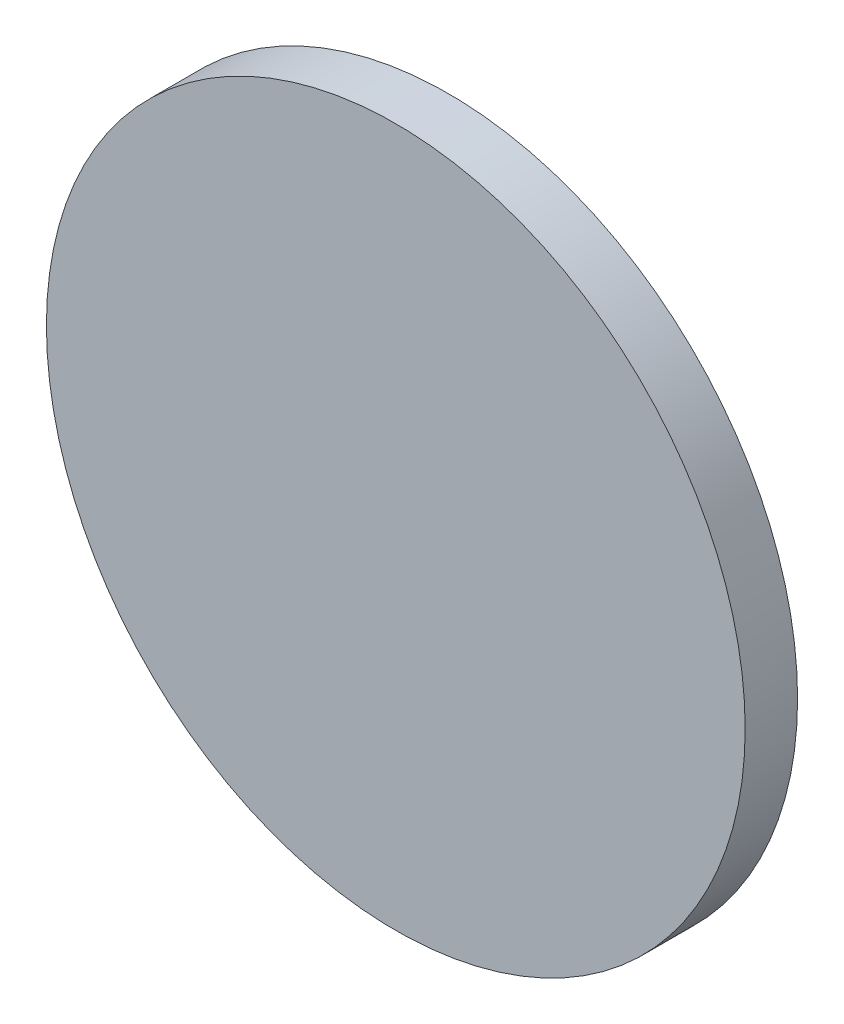
ISO-10303-21;
HEADER;
FILE_DESCRIPTION(('STEP AP214'),'2;1');
FILE_NAME('part.step','',(''),(''),'','','');
FILE_SCHEMA(('AUTOMOTIVE_DESIGN { 1 0 10303 214 1 1 1 1 }'));
ENDSEC;
DATA;
#1=APPLICATION_CONTEXT('core data for automotive mechanical design processes');
#2=APPLICATION_PROTOCOL_DEFINITION('international standard','automotive_design',2000,#1);
#3=PRODUCT_CONTEXT('',#1,'mechanical');
#4=PRODUCT('Part','Part','',(#3));
#5=PRODUCT_RELATED_PRODUCT_CATEGORY('part','',(#4));
#6=PRODUCT_DEFINITION_FORMATION('','',#4);
#7=PRODUCT_DEFINITION_CONTEXT('part definition',#1,'design');
#8=PRODUCT_DEFINITION('design','',#6,#7);
#9=PRODUCT_DEFINITION_SHAPE('','',#8);
#10=(LENGTH_UNIT() NAMED_UNIT(*) SI_UNIT(.MILLI.,.METRE.));
#11=(NAMED_UNIT(*) PLANE_ANGLE_UNIT() SI_UNIT($,.RADIAN.));
#12=(NAMED_UNIT(*) SI_UNIT($,.STERADIAN.) SOLID_ANGLE_UNIT());
#13=UNCERTAINTY_MEASURE_WITH_UNIT(LENGTH_MEASURE(1.E-05),#10,'distance_accuracy_value','');
#14=(GEOMETRIC_REPRESENTATION_CONTEXT(3) GLOBAL_UNCERTAINTY_ASSIGNED_CONTEXT((#13)) GLOBAL_UNIT_ASSIGNED_CONTEXT((#10,
#11,#12)) REPRESENTATION_CONTEXT('',''));
#15=CARTESIAN_POINT('',(0.,0.,0.));
#16=DIRECTION('',(0.,0.,1.));
#17=DIRECTION('',(1.,0.,0.));
#18=AXIS2_PLACEMENT_3D('',#15,#16,#17);
#19=CARTESIAN_POINT('',(12.53916,16.03491,0.76487));
#20=DIRECTION('',(0.,0.,-1.));
#21=DIRECTION('',(-1.,0.,0.));
#22=AXIS2_PLACEMENT_3D('',#19,#20,#21);
#23=PLANE('',#22);
#24=CARTESIAN_POINT('',(12.53916,16.03491,0.76487));
#25=DIRECTION('',(0.,0.,1.));
#26=DIRECTION('',(1.,0.,0.));
#27=AXIS2_PLACEMENT_3D('',#24,#25,#26);
#28=CIRCLE('',#27,0.2286);
#29=CARTESIAN_POINT('',(12.76776,16.03491,0.76487));
#30=VERTEX_POINT('',#29);
#31=EDGE_CURVE('E18',#30,#30,#28,.T.);
#32=ORIENTED_EDGE('',*,*,#31,.F.);
#33=EDGE_LOOP('',(#32));
#34=FACE_BOUND('',#33,.T.);
#35=ADVANCED_FACE('F15',(#34),#23,.T.);
#36=CARTESIAN_POINT('',(12.53916,16.03491,0.76487));
#37=DIRECTION('',(0.,0.,1.));
#38=DIRECTION('',(1.,0.,0.));
#39=AXIS2_PLACEMENT_3D('',#36,#37,#38);
#40=CYLINDRICAL_SURFACE('',#39,0.2286);
#41=CARTESIAN_POINT('',(12.53916,16.03491,0.79916));
#42=DIRECTION('',(0.,0.,1.));
#43=DIRECTION('',(1.,0.,0.));
#44=AXIS2_PLACEMENT_3D('',#41,#42,#43);
#45=CIRCLE('',#44,0.2286);
#46=CARTESIAN_POINT('',(12.76776,16.03491,0.79916));
#47=VERTEX_POINT('',#46);
#48=EDGE_CURVE('E10',#47,#47,#45,.T.);
#49=ORIENTED_EDGE('',*,*,#48,.F.);
#50=EDGE_LOOP('',(#49));
#51=FACE_BOUND('',#50,.T.);
#52=ORIENTED_EDGE('',*,*,#31,.T.);
#53=EDGE_LOOP('',(#52));
#54=FACE_BOUND('',#53,.T.);
#55=ADVANCED_FACE('F27',(#51,#54),#40,.T.);
#56=CARTESIAN_POINT('',(12.53916,16.03491,0.79916));
#57=DIRECTION('',(0.,0.,1.));
#58=DIRECTION('',(1.,0.,0.));
#59=AXIS2_PLACEMENT_3D('',#56,#57,#58);
#60=PLANE('',#59);
#61=ORIENTED_EDGE('',*,*,#48,.T.);
#62=EDGE_LOOP('',(#61));
#63=FACE_BOUND('',#62,.T.);
#64=ADVANCED_FACE('F34',(#63),#60,.T.);
#65=CLOSED_SHELL('',(#35,#55,#64));
#66=MANIFOLD_SOLID_BREP('B1',#65);
#67=ADVANCED_BREP_SHAPE_REPRESENTATION('',(#18,#66),#14);
#68=SHAPE_DEFINITION_REPRESENTATION(#9,#67);
ENDSEC;
END-ISO-10303-21;
